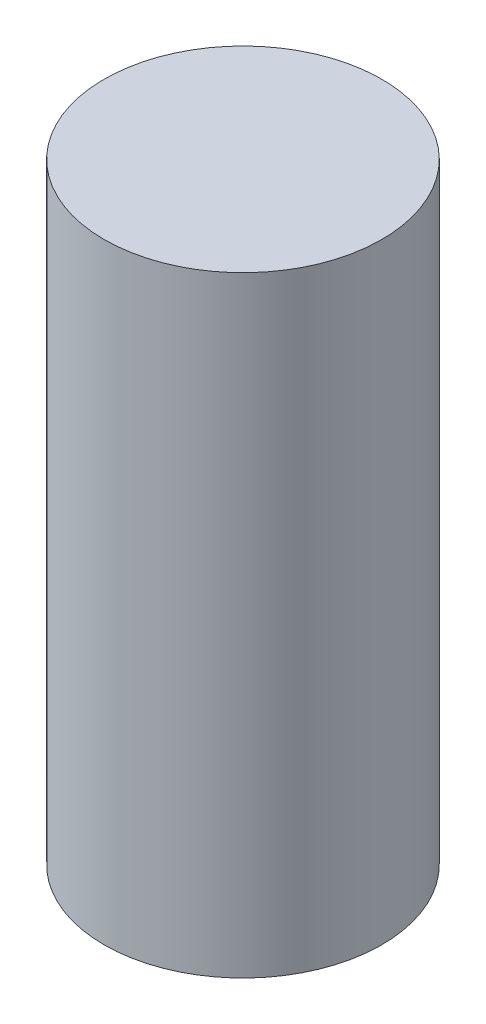
ISO-10303-21;
HEADER;
FILE_DESCRIPTION(('STEP AP214'),'2;1');
FILE_NAME('part.step','',(''),(''),'','','');
FILE_SCHEMA(('AUTOMOTIVE_DESIGN { 1 0 10303 214 1 1 1 1 }'));
ENDSEC;
DATA;
#1=APPLICATION_CONTEXT('core data for automotive mechanical design processes');
#2=APPLICATION_PROTOCOL_DEFINITION('international standard','automotive_design',2000,#1);
#3=PRODUCT_CONTEXT('',#1,'mechanical');
#4=PRODUCT('Part','Part','',(#3));
#5=PRODUCT_RELATED_PRODUCT_CATEGORY('part','',(#4));
#6=PRODUCT_DEFINITION_FORMATION('','',#4);
#7=PRODUCT_DEFINITION_CONTEXT('part definition',#1,'design');
#8=PRODUCT_DEFINITION('design','',#6,#7);
#9=PRODUCT_DEFINITION_SHAPE('','',#8);
#10=(LENGTH_UNIT() NAMED_UNIT(*) SI_UNIT(.MILLI.,.METRE.));
#11=(NAMED_UNIT(*) PLANE_ANGLE_UNIT() SI_UNIT($,.RADIAN.));
#12=(NAMED_UNIT(*) SI_UNIT($,.STERADIAN.) SOLID_ANGLE_UNIT());
#13=UNCERTAINTY_MEASURE_WITH_UNIT(LENGTH_MEASURE(1.E-05),#10,'distance_accuracy_value','');
#14=(GEOMETRIC_REPRESENTATION_CONTEXT(3) GLOBAL_UNCERTAINTY_ASSIGNED_CONTEXT((#13)) GLOBAL_UNIT_ASSIGNED_CONTEXT((#10,
#11,#12)) REPRESENTATION_CONTEXT('',''));
#15=CARTESIAN_POINT('',(0.,0.,0.));
#16=DIRECTION('',(0.,0.,1.));
#17=DIRECTION('',(1.,0.,0.));
#18=AXIS2_PLACEMENT_3D('',#15,#16,#17);
#19=CARTESIAN_POINT('',(0.,110.,0.));
#20=DIRECTION('',(0.,-1.,0.));
#21=DIRECTION('',(0.,0.,-1.));
#22=AXIS2_PLACEMENT_3D('',#19,#20,#21);
#23=CYLINDRICAL_SURFACE('',#22,25.);
#24=CARTESIAN_POINT('',(0.,110.,0.));
#25=DIRECTION('',(0.,1.,0.));
#26=DIRECTION('',(0.,0.,1.));
#27=AXIS2_PLACEMENT_3D('',#24,#25,#26);
#28=CIRCLE('',#27,25.);
#29=CARTESIAN_POINT('',(0.,110.,25.));
#30=VERTEX_POINT('',#29);
#31=EDGE_CURVE('E10',#30,#30,#28,.T.);
#32=ORIENTED_EDGE('',*,*,#31,.F.);
#33=EDGE_LOOP('',(#32));
#34=FACE_BOUND('',#33,.T.);
#35=CARTESIAN_POINT('',(0.,0.,0.));
#36=DIRECTION('',(0.,1.,0.));
#37=DIRECTION('',(0.,0.,1.));
#38=AXIS2_PLACEMENT_3D('',#35,#36,#37);
#39=CIRCLE('',#38,25.);
#40=CARTESIAN_POINT('',(0.,0.,25.));
#41=VERTEX_POINT('',#40);
#42=EDGE_CURVE('E38',#41,#41,#39,.T.);
#43=ORIENTED_EDGE('',*,*,#42,.T.);
#44=EDGE_LOOP('',(#43));
#45=FACE_BOUND('',#44,.T.);
#46=ADVANCED_FACE('F35',(#34,#45),#23,.T.);
#47=CARTESIAN_POINT('',(0.,110.,0.));
#48=DIRECTION('',(0.,1.,0.));
#49=DIRECTION('',(0.,0.,1.));
#50=AXIS2_PLACEMENT_3D('',#47,#48,#49);
#51=PLANE('',#50);
#52=ORIENTED_EDGE('',*,*,#31,.T.);
#53=EDGE_LOOP('',(#52));
#54=FACE_BOUND('',#53,.T.);
#55=ADVANCED_FACE('F50',(#54),#51,.T.);
#56=CARTESIAN_POINT('',(0.,0.,0.));
#57=DIRECTION('',(0.,1.,0.));
#58=DIRECTION('',(0.,0.,1.));
#59=AXIS2_PLACEMENT_3D('',#56,#57,#58);
#60=PLANE('',#59);
#61=ORIENTED_EDGE('',*,*,#42,.F.);
#62=EDGE_LOOP('',(#61));
#63=FACE_BOUND('',#62,.T.);
#64=ADVANCED_FACE('F48',(#63),#60,.F.);
#65=CLOSED_SHELL('',(#46,#55,#64));
#66=MANIFOLD_SOLID_BREP('B2',#65);
#67=ADVANCED_BREP_SHAPE_REPRESENTATION('',(#18,#66),#14);
#68=SHAPE_DEFINITION_REPRESENTATION(#9,#67);
ENDSEC;
END-ISO-10303-21;
